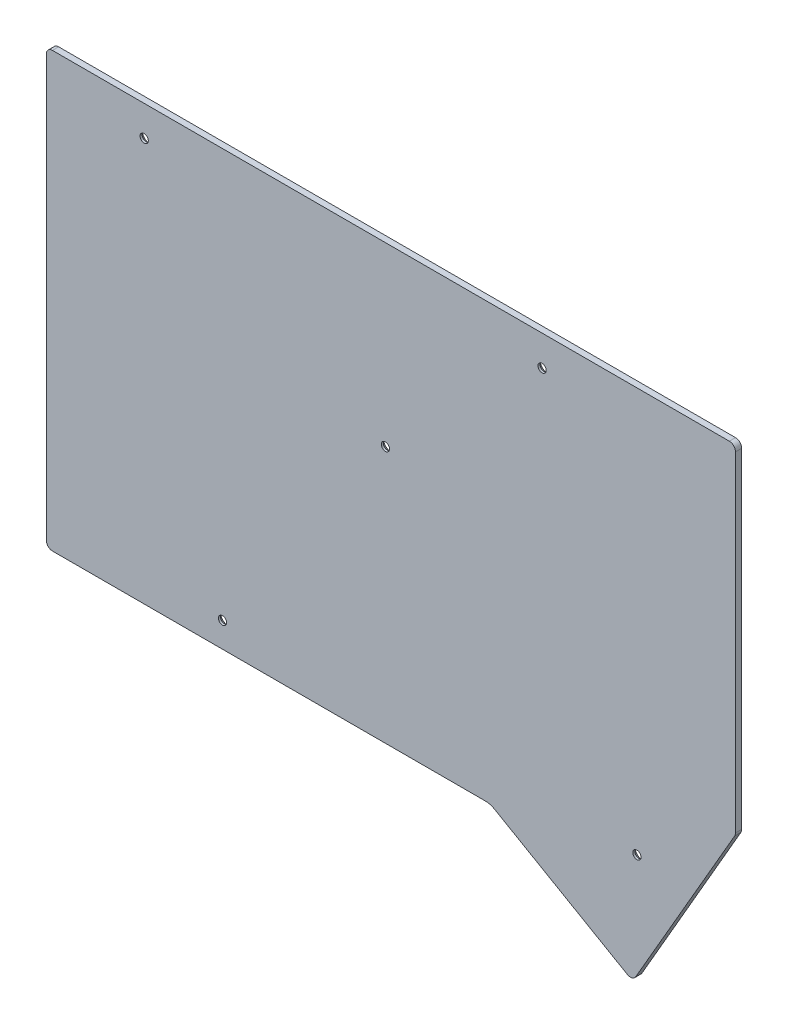
ISO-10303-21;
HEADER;
FILE_DESCRIPTION(('STEP AP214'),'2;1');
FILE_NAME('part.step','',(''),(''),'','','');
FILE_SCHEMA(('AUTOMOTIVE_DESIGN { 1 0 10303 214 1 1 1 1 }'));
ENDSEC;
DATA;
#1=APPLICATION_CONTEXT('core data for automotive mechanical design processes');
#2=APPLICATION_PROTOCOL_DEFINITION('international standard','automotive_design',2000,#1);
#3=PRODUCT_CONTEXT('',#1,'mechanical');
#4=PRODUCT('Part','Part','',(#3));
#5=PRODUCT_RELATED_PRODUCT_CATEGORY('part','',(#4));
#6=PRODUCT_DEFINITION_FORMATION('','',#4);
#7=PRODUCT_DEFINITION_CONTEXT('part definition',#1,'design');
#8=PRODUCT_DEFINITION('design','',#6,#7);
#9=PRODUCT_DEFINITION_SHAPE('','',#8);
#10=(LENGTH_UNIT() NAMED_UNIT(*) SI_UNIT(.MILLI.,.METRE.));
#11=(NAMED_UNIT(*) PLANE_ANGLE_UNIT() SI_UNIT($,.RADIAN.));
#12=(NAMED_UNIT(*) SI_UNIT($,.STERADIAN.) SOLID_ANGLE_UNIT());
#13=UNCERTAINTY_MEASURE_WITH_UNIT(LENGTH_MEASURE(1.E-05),#10,'distance_accuracy_value','');
#14=(GEOMETRIC_REPRESENTATION_CONTEXT(3) GLOBAL_UNCERTAINTY_ASSIGNED_CONTEXT((#13)) GLOBAL_UNIT_ASSIGNED_CONTEXT((#10,
#11,#12)) REPRESENTATION_CONTEXT('',''));
#15=CARTESIAN_POINT('',(0.,0.,0.));
#16=DIRECTION('',(0.,0.,1.));
#17=DIRECTION('',(1.,0.,0.));
#18=AXIS2_PLACEMENT_3D('',#15,#16,#17);
#19=CARTESIAN_POINT('',(20.7161288004973,150.424941971607,1.5));
#20=DIRECTION('',(0.,0.,1.));
#21=DIRECTION('',(1.,0.,0.));
#22=AXIS2_PLACEMENT_3D('',#19,#20,#21);
#23=PLANE('',#22);
#24=CARTESIAN_POINT('',(-102.196571110257,52.8250509716065,1.5));
#25=DIRECTION('',(0.,0.,1.));
#26=DIRECTION('',(1.,0.,0.));
#27=AXIS2_PLACEMENT_3D('',#24,#25,#26);
#28=CIRCLE('',#27,0.999999999999998);
#29=CARTESIAN_POINT('',(-101.196571110257,52.8250509716065,1.5));
#30=VERTEX_POINT('',#29);
#31=EDGE_CURVE('E336',#30,#30,#28,.T.);
#32=ORIENTED_EDGE('',*,*,#31,.F.);
#33=EDGE_LOOP('',(#32));
#34=FACE_BOUND('',#33,.T.);
#35=CARTESIAN_POINT('',(-121.196571210257,144.575050351607,1.5));
#36=DIRECTION('',(0.,0.,1.));
#37=DIRECTION('',(1.,0.,0.));
#38=AXIS2_PLACEMENT_3D('',#35,#36,#37);
#39=CIRCLE('',#38,0.999999999999998);
#40=CARTESIAN_POINT('',(-120.196571210257,144.575050351607,1.5));
#41=VERTEX_POINT('',#40);
#42=EDGE_CURVE('E335',#41,#41,#39,.T.);
#43=ORIENTED_EDGE('',*,*,#42,.F.);
#44=EDGE_LOOP('',(#43));
#45=FACE_BOUND('',#44,.T.);
#46=CARTESIAN_POINT('',(20.7161288004973,150.424941971607,1.5));
#47=DIRECTION('',(0.,0.,1.));
#48=DIRECTION('',(1.,0.,0.));
#49=AXIS2_PLACEMENT_3D('',#46,#47,#48);
#50=CIRCLE('',#49,1.5);
#51=CARTESIAN_POINT('',(22.2161288004973,150.424941971607,1.5));
#52=VERTEX_POINT('',#51);
#53=CARTESIAN_POINT('',(20.7161288004973,151.924941971607,1.5));
#54=VERTEX_POINT('',#53);
#55=EDGE_CURVE('E184',#52,#54,#50,.T.);
#56=ORIENTED_EDGE('',*,*,#55,.T.);
#57=DIRECTION('',(-1.,0.,0.));
#58=VECTOR('',#57,1.);
#59=CARTESIAN_POINT('',(20.7161288004973,151.924941971607,1.5));
#60=LINE('',#59,#58);
#61=CARTESIAN_POINT('',(-143.433871890257,151.924941971607,1.5));
#62=VERTEX_POINT('',#61);
#63=EDGE_CURVE('E112',#54,#62,#60,.T.);
#64=ORIENTED_EDGE('',*,*,#63,.T.);
#65=CARTESIAN_POINT('',(-143.433871890257,150.424941971607,1.5));
#66=DIRECTION('',(0.,0.,1.));
#67=DIRECTION('',(1.,0.,0.));
#68=AXIS2_PLACEMENT_3D('',#65,#66,#67);
#69=CIRCLE('',#68,1.5);
#70=CARTESIAN_POINT('',(-144.933871890257,150.424941971607,1.5));
#71=VERTEX_POINT('',#70);
#72=EDGE_CURVE('E349',#62,#71,#69,.T.);
#73=ORIENTED_EDGE('',*,*,#72,.T.);
#74=DIRECTION('',(0.,-1.,0.));
#75=VECTOR('',#74,1.);
#76=CARTESIAN_POINT('',(-144.933871890257,150.424941971607,1.5));
#77=LINE('',#76,#75);
#78=CARTESIAN_POINT('',(-144.933871890257,48.2618170516065,1.5));
#79=VERTEX_POINT('',#78);
#80=EDGE_CURVE('E351',#71,#79,#77,.T.);
#81=ORIENTED_EDGE('',*,*,#80,.T.);
#82=CARTESIAN_POINT('',(-143.433871890257,48.2618170516065,1.5));
#83=DIRECTION('',(0.,0.,1.));
#84=DIRECTION('',(1.,0.,0.));
#85=AXIS2_PLACEMENT_3D('',#82,#83,#84);
#86=CIRCLE('',#85,1.5);
#87=CARTESIAN_POINT('',(-143.433871890257,46.7618170516065,1.5));
#88=VERTEX_POINT('',#87);
#89=EDGE_CURVE('E353',#79,#88,#86,.T.);
#90=ORIENTED_EDGE('',*,*,#89,.T.);
#91=DIRECTION('',(1.,0.,0.));
#92=VECTOR('',#91,1.);
#93=CARTESIAN_POINT('',(-143.433871890257,46.7618170516065,1.5));
#94=LINE('',#93,#92);
#95=CARTESIAN_POINT('',(-38.493629317275,46.7618170516065,1.5));
#96=VERTEX_POINT('',#95);
#97=EDGE_CURVE('E355',#88,#96,#94,.T.);
#98=ORIENTED_EDGE('',*,*,#97,.T.);
#99=CARTESIAN_POINT('',(-38.493629317275,42.2618170516065,1.5));
#100=DIRECTION('',(0.,0.,-1.));
#101=DIRECTION('',(1.,0.,0.));
#102=AXIS2_PLACEMENT_3D('',#99,#100,#101);
#103=CIRCLE('',#102,4.5);
#104=CARTESIAN_POINT('',(-36.243629317275,46.1589313686365,1.5));
#105=VERTEX_POINT('',#104);
#106=EDGE_CURVE('E357',#96,#105,#103,.T.);
#107=ORIENTED_EDGE('',*,*,#106,.T.);
#108=DIRECTION('',(0.866025403784439,-0.5,0.));
#109=VECTOR('',#108,1.);
#110=CARTESIAN_POINT('',(-36.243629317275,46.1589313686365,1.5));
#111=LINE('',#110,#109);
#112=CARTESIAN_POINT('',(-4.01784738203959,27.5533674934822,1.5));
#113=VERTEX_POINT('',#112);
#114=EDGE_CURVE('E359',#105,#113,#111,.T.);
#115=ORIENTED_EDGE('',*,*,#114,.T.);
#116=CARTESIAN_POINT('',(-3.26784738203961,28.8524055991589,1.5));
#117=DIRECTION('',(0.,0.,1.));
#118=DIRECTION('',(1.,0.,0.));
#119=AXIS2_PLACEMENT_3D('',#116,#117,#118);
#120=CIRCLE('',#119,1.5);
#121=CARTESIAN_POINT('',(-1.96880929915792,28.1024055596768,1.5));
#122=VERTEX_POINT('',#121);
#123=EDGE_CURVE('E143',#113,#122,#120,.T.);
#124=ORIENTED_EDGE('',*,*,#123,.T.);
#125=DIRECTION('',(0.500000026321354,0.866025388587797,0.));
#126=VECTOR('',#125,1.);
#127=CARTESIAN_POINT('',(-1.96880929915792,28.1024055596768,1.5));
#128=LINE('',#127,#126);
#129=CARTESIAN_POINT('',(22.015166883379,69.6438679595458,1.5));
#130=VERTEX_POINT('',#129);
#131=EDGE_CURVE('E137',#122,#130,#128,.T.);
#132=ORIENTED_EDGE('',*,*,#131,.T.);
#133=CARTESIAN_POINT('',(20.7161288004973,70.3938679990278,1.5));
#134=DIRECTION('',(0.,0.,1.));
#135=DIRECTION('',(1.,0.,0.));
#136=AXIS2_PLACEMENT_3D('',#133,#134,#135);
#137=CIRCLE('',#136,1.50000000000001);
#138=CARTESIAN_POINT('',(22.2161288004973,70.3938679990278,1.5));
#139=VERTEX_POINT('',#138);
#140=EDGE_CURVE('E141',#130,#139,#137,.T.);
#141=ORIENTED_EDGE('',*,*,#140,.T.);
#142=DIRECTION('',(0.,1.,0.));
#143=VECTOR('',#142,1.);
#144=CARTESIAN_POINT('',(22.2161288004973,70.3938679990278,1.5));
#145=LINE('',#144,#143);
#146=EDGE_CURVE('E56',#139,#52,#145,.T.);
#147=ORIENTED_EDGE('',*,*,#146,.T.);
#148=EDGE_LOOP('',(#56,#64,#73,#81,#90,#98,#107,#115,#124,#132,#141,#147));
#149=FACE_BOUND('',#148,.T.);
#150=CARTESIAN_POINT('',(-24.6965711702571,144.575050351607,1.5));
#151=DIRECTION('',(0.,0.,1.));
#152=DIRECTION('',(1.,0.,0.));
#153=AXIS2_PLACEMENT_3D('',#150,#151,#152);
#154=CIRCLE('',#153,1.);
#155=CARTESIAN_POINT('',(-23.6965711702571,144.575050351607,1.5));
#156=VERTEX_POINT('',#155);
#157=EDGE_CURVE('E165',#156,#156,#154,.T.);
#158=ORIENTED_EDGE('',*,*,#157,.F.);
#159=EDGE_LOOP('',(#158));
#160=FACE_BOUND('',#159,.T.);
#161=CARTESIAN_POINT('',(-62.6965713702571,109.075050231607,1.5));
#162=DIRECTION('',(0.,0.,1.));
#163=DIRECTION('',(1.,0.,0.));
#164=AXIS2_PLACEMENT_3D('',#161,#162,#163);
#165=CIRCLE('',#164,0.999999999999998);
#166=CARTESIAN_POINT('',(-61.6965713702571,109.075050231607,1.5));
#167=VERTEX_POINT('',#166);
#168=EDGE_CURVE('E333',#167,#167,#165,.T.);
#169=ORIENTED_EDGE('',*,*,#168,.F.);
#170=EDGE_LOOP('',(#169));
#171=FACE_BOUND('',#170,.T.);
#172=CARTESIAN_POINT('',(-1.69657145025712,53.8250489716065,1.5));
#173=DIRECTION('',(0.,0.,1.));
#174=DIRECTION('',(1.,0.,0.));
#175=AXIS2_PLACEMENT_3D('',#172,#173,#174);
#176=CIRCLE('',#175,1.);
#177=CARTESIAN_POINT('',(-0.696571450257117,53.8250489716065,1.5));
#178=VERTEX_POINT('',#177);
#179=EDGE_CURVE('E341',#178,#178,#176,.T.);
#180=ORIENTED_EDGE('',*,*,#179,.F.);
#181=EDGE_LOOP('',(#180));
#182=FACE_BOUND('',#181,.T.);
#183=ADVANCED_FACE('F38',(#34,#45,#149,#160,#171,#182),#23,.T.);
#184=CARTESIAN_POINT('',(20.7161288004973,150.424941971607,0.));
#185=DIRECTION('',(0.,0.,1.));
#186=DIRECTION('',(1.,0.,0.));
#187=AXIS2_PLACEMENT_3D('',#184,#185,#186);
#188=PLANE('',#187);
#189=CARTESIAN_POINT('',(-24.6965711702571,144.575050351607,0.));
#190=DIRECTION('',(0.,0.,1.));
#191=DIRECTION('',(1.,0.,0.));
#192=AXIS2_PLACEMENT_3D('',#189,#190,#191);
#193=CIRCLE('',#192,1.99999999999997);
#194=CARTESIAN_POINT('',(-22.6965711702572,144.575050351607,0.));
#195=VERTEX_POINT('',#194);
#196=EDGE_CURVE('E223',#195,#195,#193,.T.);
#197=ORIENTED_EDGE('',*,*,#196,.T.);
#198=EDGE_LOOP('',(#197));
#199=FACE_BOUND('',#198,.T.);
#200=CARTESIAN_POINT('',(-121.196571210257,144.575050351607,0.));
#201=DIRECTION('',(0.,0.,1.));
#202=DIRECTION('',(1.,0.,0.));
#203=AXIS2_PLACEMENT_3D('',#200,#201,#202);
#204=CIRCLE('',#203,2.00000000000003);
#205=CARTESIAN_POINT('',(-119.196571210257,144.575050351607,0.));
#206=VERTEX_POINT('',#205);
#207=EDGE_CURVE('E220',#206,#206,#204,.T.);
#208=ORIENTED_EDGE('',*,*,#207,.T.);
#209=EDGE_LOOP('',(#208));
#210=FACE_BOUND('',#209,.T.);
#211=CARTESIAN_POINT('',(-62.6965713702571,109.075050231607,0.));
#212=DIRECTION('',(0.,0.,1.));
#213=DIRECTION('',(1.,0.,0.));
#214=AXIS2_PLACEMENT_3D('',#211,#212,#213);
#215=CIRCLE('',#214,2.00000000000003);
#216=CARTESIAN_POINT('',(-60.6965713702571,109.075050231607,0.));
#217=VERTEX_POINT('',#216);
#218=EDGE_CURVE('E217',#217,#217,#215,.T.);
#219=ORIENTED_EDGE('',*,*,#218,.T.);
#220=EDGE_LOOP('',(#219));
#221=FACE_BOUND('',#220,.T.);
#222=CARTESIAN_POINT('',(-1.69657145025712,53.8250489716065,0.));
#223=DIRECTION('',(0.,0.,1.));
#224=DIRECTION('',(1.,0.,0.));
#225=AXIS2_PLACEMENT_3D('',#222,#223,#224);
#226=CIRCLE('',#225,1.99999999999997);
#227=CARTESIAN_POINT('',(0.303428549742857,53.8250489716065,0.));
#228=VERTEX_POINT('',#227);
#229=EDGE_CURVE('E214',#228,#228,#226,.T.);
#230=ORIENTED_EDGE('',*,*,#229,.T.);
#231=EDGE_LOOP('',(#230));
#232=FACE_BOUND('',#231,.T.);
#233=CARTESIAN_POINT('',(-102.196571110257,52.8250509716065,0.));
#234=DIRECTION('',(0.,0.,1.));
#235=DIRECTION('',(1.,0.,0.));
#236=AXIS2_PLACEMENT_3D('',#233,#234,#235);
#237=CIRCLE('',#236,2.00000000000003);
#238=CARTESIAN_POINT('',(-100.196571110257,52.8250509716065,0.));
#239=VERTEX_POINT('',#238);
#240=EDGE_CURVE('E211',#239,#239,#237,.T.);
#241=ORIENTED_EDGE('',*,*,#240,.T.);
#242=EDGE_LOOP('',(#241));
#243=FACE_BOUND('',#242,.T.);
#244=CARTESIAN_POINT('',(20.7161288004973,150.424941971607,0.));
#245=DIRECTION('',(0.,0.,1.));
#246=DIRECTION('',(1.,0.,0.));
#247=AXIS2_PLACEMENT_3D('',#244,#245,#246);
#248=CIRCLE('',#247,1.5);
#249=CARTESIAN_POINT('',(22.2161288004973,150.424941971607,0.));
#250=VERTEX_POINT('',#249);
#251=CARTESIAN_POINT('',(20.7161288004973,151.924941971607,0.));
#252=VERTEX_POINT('',#251);
#253=EDGE_CURVE('E161',#250,#252,#248,.T.);
#254=ORIENTED_EDGE('',*,*,#253,.F.);
#255=DIRECTION('',(0.,1.,0.));
#256=VECTOR('',#255,1.);
#257=CARTESIAN_POINT('',(22.2161288004973,70.3938679990278,0.));
#258=LINE('',#257,#256);
#259=CARTESIAN_POINT('',(22.2161288004973,70.3938679990278,0.));
#260=VERTEX_POINT('',#259);
#261=EDGE_CURVE('E103',#260,#250,#258,.T.);
#262=ORIENTED_EDGE('',*,*,#261,.F.);
#263=CARTESIAN_POINT('',(20.7161288004973,70.3938679990278,0.));
#264=DIRECTION('',(0.,0.,1.));
#265=DIRECTION('',(1.,0.,0.));
#266=AXIS2_PLACEMENT_3D('',#263,#264,#265);
#267=CIRCLE('',#266,1.50000000000001);
#268=CARTESIAN_POINT('',(22.015166883379,69.6438679595458,0.));
#269=VERTEX_POINT('',#268);
#270=EDGE_CURVE('E97',#269,#260,#267,.T.);
#271=ORIENTED_EDGE('',*,*,#270,.F.);
#272=DIRECTION('',(0.500000026321354,0.866025388587797,0.));
#273=VECTOR('',#272,1.);
#274=CARTESIAN_POINT('',(-1.96880929915792,28.1024055596768,0.));
#275=LINE('',#274,#273);
#276=CARTESIAN_POINT('',(-1.96880929915792,28.1024055596768,0.));
#277=VERTEX_POINT('',#276);
#278=EDGE_CURVE('E151',#277,#269,#275,.T.);
#279=ORIENTED_EDGE('',*,*,#278,.F.);
#280=CARTESIAN_POINT('',(-3.26784738203961,28.8524055991589,0.));
#281=DIRECTION('',(0.,0.,1.));
#282=DIRECTION('',(1.,0.,0.));
#283=AXIS2_PLACEMENT_3D('',#280,#281,#282);
#284=CIRCLE('',#283,1.5);
#285=CARTESIAN_POINT('',(-4.01784738203959,27.5533674934822,0.));
#286=VERTEX_POINT('',#285);
#287=EDGE_CURVE('E179',#286,#277,#284,.T.);
#288=ORIENTED_EDGE('',*,*,#287,.F.);
#289=DIRECTION('',(0.866025403784439,-0.5,0.));
#290=VECTOR('',#289,1.);
#291=CARTESIAN_POINT('',(-36.243629317275,46.1589313686365,0.));
#292=LINE('',#291,#290);
#293=CARTESIAN_POINT('',(-36.243629317275,46.1589313686365,0.));
#294=VERTEX_POINT('',#293);
#295=EDGE_CURVE('E177',#294,#286,#292,.T.);
#296=ORIENTED_EDGE('',*,*,#295,.F.);
#297=CARTESIAN_POINT('',(-38.493629317275,42.2618170516065,0.));
#298=DIRECTION('',(0.,0.,-1.));
#299=DIRECTION('',(1.,0.,0.));
#300=AXIS2_PLACEMENT_3D('',#297,#298,#299);
#301=CIRCLE('',#300,4.5);
#302=CARTESIAN_POINT('',(-38.493629317275,46.7618170516065,0.));
#303=VERTEX_POINT('',#302);
#304=EDGE_CURVE('E175',#303,#294,#301,.T.);
#305=ORIENTED_EDGE('',*,*,#304,.F.);
#306=DIRECTION('',(1.,0.,0.));
#307=VECTOR('',#306,1.);
#308=CARTESIAN_POINT('',(-143.433871890257,46.7618170516065,0.));
#309=LINE('',#308,#307);
#310=CARTESIAN_POINT('',(-143.433871890257,46.7618170516065,0.));
#311=VERTEX_POINT('',#310);
#312=EDGE_CURVE('E173',#311,#303,#309,.T.);
#313=ORIENTED_EDGE('',*,*,#312,.F.);
#314=CARTESIAN_POINT('',(-143.433871890257,48.2618170516065,0.));
#315=DIRECTION('',(0.,0.,1.));
#316=DIRECTION('',(1.,0.,0.));
#317=AXIS2_PLACEMENT_3D('',#314,#315,#316);
#318=CIRCLE('',#317,1.5);
#319=CARTESIAN_POINT('',(-144.933871890257,48.2618170516065,0.));
#320=VERTEX_POINT('',#319);
#321=EDGE_CURVE('E171',#320,#311,#318,.T.);
#322=ORIENTED_EDGE('',*,*,#321,.F.);
#323=DIRECTION('',(0.,-1.,0.));
#324=VECTOR('',#323,1.);
#325=CARTESIAN_POINT('',(-144.933871890257,150.424941971607,0.));
#326=LINE('',#325,#324);
#327=CARTESIAN_POINT('',(-144.933871890257,150.424941971607,0.));
#328=VERTEX_POINT('',#327);
#329=EDGE_CURVE('E169',#328,#320,#326,.T.);
#330=ORIENTED_EDGE('',*,*,#329,.F.);
#331=CARTESIAN_POINT('',(-143.433871890257,150.424941971607,0.));
#332=DIRECTION('',(0.,0.,1.));
#333=DIRECTION('',(1.,0.,0.));
#334=AXIS2_PLACEMENT_3D('',#331,#332,#333);
#335=CIRCLE('',#334,1.5);
#336=CARTESIAN_POINT('',(-143.433871890257,151.924941971607,0.));
#337=VERTEX_POINT('',#336);
#338=EDGE_CURVE('E167',#337,#328,#335,.T.);
#339=ORIENTED_EDGE('',*,*,#338,.F.);
#340=DIRECTION('',(-1.,0.,0.));
#341=VECTOR('',#340,1.);
#342=CARTESIAN_POINT('',(20.7161288004973,151.924941971607,0.));
#343=LINE('',#342,#341);
#344=EDGE_CURVE('E164',#252,#337,#343,.T.);
#345=ORIENTED_EDGE('',*,*,#344,.F.);
#346=EDGE_LOOP('',(#254,#262,#271,#279,#288,#296,#305,#313,#322,#330,#339,#345));
#347=FACE_BOUND('',#346,.T.);
#348=ADVANCED_FACE('F246',(#199,#210,#221,#232,#243,#347),#188,.F.);
#349=CARTESIAN_POINT('',(20.7161288004973,150.424941971607,1.5));
#350=DIRECTION('',(0.,0.,-1.));
#351=DIRECTION('',(-1.,0.,0.));
#352=AXIS2_PLACEMENT_3D('',#349,#350,#351);
#353=CYLINDRICAL_SURFACE('',#352,1.5);
#354=ORIENTED_EDGE('',*,*,#253,.T.);
#355=DIRECTION('',(0.,0.,-1.));
#356=VECTOR('',#355,1.);
#357=CARTESIAN_POINT('',(20.7161288004973,151.924941971607,1.5));
#358=LINE('',#357,#356);
#359=EDGE_CURVE('E209',#54,#252,#358,.T.);
#360=ORIENTED_EDGE('',*,*,#359,.F.);
#361=ORIENTED_EDGE('',*,*,#55,.F.);
#362=DIRECTION('',(0.,0.,-1.));
#363=VECTOR('',#362,1.);
#364=CARTESIAN_POINT('',(22.2161288004973,150.424941971607,1.5));
#365=LINE('',#364,#363);
#366=EDGE_CURVE('E157',#52,#250,#365,.T.);
#367=ORIENTED_EDGE('',*,*,#366,.T.);
#368=EDGE_LOOP('',(#354,#360,#361,#367));
#369=FACE_BOUND('',#368,.T.);
#370=ADVANCED_FACE('F249',(#369),#353,.T.);
#371=CARTESIAN_POINT('',(20.7161288004973,151.924941971607,1.5));
#372=DIRECTION('',(0.,-1.,0.));
#373=DIRECTION('',(1.,0.,0.));
#374=AXIS2_PLACEMENT_3D('',#371,#372,#373);
#375=PLANE('',#374);
#376=ORIENTED_EDGE('',*,*,#344,.T.);
#377=DIRECTION('',(0.,0.,-1.));
#378=VECTOR('',#377,1.);
#379=CARTESIAN_POINT('',(-143.433871890257,151.924941971607,1.5));
#380=LINE('',#379,#378);
#381=EDGE_CURVE('E206',#62,#337,#380,.T.);
#382=ORIENTED_EDGE('',*,*,#381,.F.);
#383=ORIENTED_EDGE('',*,*,#63,.F.);
#384=ORIENTED_EDGE('',*,*,#359,.T.);
#385=EDGE_LOOP('',(#376,#382,#383,#384));
#386=FACE_BOUND('',#385,.T.);
#387=ADVANCED_FACE('F392',(#386),#375,.F.);
#388=CARTESIAN_POINT('',(-143.433871890257,150.424941971607,1.5));
#389=DIRECTION('',(0.,0.,-1.));
#390=DIRECTION('',(-1.,0.,0.));
#391=AXIS2_PLACEMENT_3D('',#388,#389,#390);
#392=CYLINDRICAL_SURFACE('',#391,1.5);
#393=ORIENTED_EDGE('',*,*,#338,.T.);
#394=DIRECTION('',(0.,0.,-1.));
#395=VECTOR('',#394,1.);
#396=CARTESIAN_POINT('',(-144.933871890257,150.424941971607,1.5));
#397=LINE('',#396,#395);
#398=EDGE_CURVE('E203',#71,#328,#397,.T.);
#399=ORIENTED_EDGE('',*,*,#398,.F.);
#400=ORIENTED_EDGE('',*,*,#72,.F.);
#401=ORIENTED_EDGE('',*,*,#381,.T.);
#402=EDGE_LOOP('',(#393,#399,#400,#401));
#403=FACE_BOUND('',#402,.T.);
#404=ADVANCED_FACE('F391',(#403),#392,.T.);
#405=CARTESIAN_POINT('',(-144.933871890257,150.424941971607,1.5));
#406=DIRECTION('',(1.,0.,0.));
#407=DIRECTION('',(0.,0.,-1.));
#408=AXIS2_PLACEMENT_3D('',#405,#406,#407);
#409=PLANE('',#408);
#410=ORIENTED_EDGE('',*,*,#329,.T.);
#411=DIRECTION('',(0.,0.,-1.));
#412=VECTOR('',#411,1.);
#413=CARTESIAN_POINT('',(-144.933871890257,48.2618170516065,1.5));
#414=LINE('',#413,#412);
#415=EDGE_CURVE('E200',#79,#320,#414,.T.);
#416=ORIENTED_EDGE('',*,*,#415,.F.);
#417=ORIENTED_EDGE('',*,*,#80,.F.);
#418=ORIENTED_EDGE('',*,*,#398,.T.);
#419=EDGE_LOOP('',(#410,#416,#417,#418));
#420=FACE_BOUND('',#419,.T.);
#421=ADVANCED_FACE('F386',(#420),#409,.F.);
#422=CARTESIAN_POINT('',(-143.433871890257,48.2618170516065,1.5));
#423=DIRECTION('',(0.,0.,-1.));
#424=DIRECTION('',(-1.,0.,0.));
#425=AXIS2_PLACEMENT_3D('',#422,#423,#424);
#426=CYLINDRICAL_SURFACE('',#425,1.5);
#427=ORIENTED_EDGE('',*,*,#321,.T.);
#428=DIRECTION('',(0.,0.,-1.));
#429=VECTOR('',#428,1.);
#430=CARTESIAN_POINT('',(-143.433871890257,46.7618170516065,1.5));
#431=LINE('',#430,#429);
#432=EDGE_CURVE('E197',#88,#311,#431,.T.);
#433=ORIENTED_EDGE('',*,*,#432,.F.);
#434=ORIENTED_EDGE('',*,*,#89,.F.);
#435=ORIENTED_EDGE('',*,*,#415,.T.);
#436=EDGE_LOOP('',(#427,#433,#434,#435));
#437=FACE_BOUND('',#436,.T.);
#438=ADVANCED_FACE('F382',(#437),#426,.T.);
#439=CARTESIAN_POINT('',(-143.433871890257,46.7618170516065,1.5));
#440=DIRECTION('',(0.,1.,0.));
#441=DIRECTION('',(0.,0.,1.));
#442=AXIS2_PLACEMENT_3D('',#439,#440,#441);
#443=PLANE('',#442);
#444=ORIENTED_EDGE('',*,*,#312,.T.);
#445=DIRECTION('',(0.,0.,-1.));
#446=VECTOR('',#445,1.);
#447=CARTESIAN_POINT('',(-38.493629317275,46.7618170516065,1.5));
#448=LINE('',#447,#446);
#449=EDGE_CURVE('E194',#96,#303,#448,.T.);
#450=ORIENTED_EDGE('',*,*,#449,.F.);
#451=ORIENTED_EDGE('',*,*,#97,.F.);
#452=ORIENTED_EDGE('',*,*,#432,.T.);
#453=EDGE_LOOP('',(#444,#450,#451,#452));
#454=FACE_BOUND('',#453,.T.);
#455=ADVANCED_FACE('F378',(#454),#443,.F.);
#456=CARTESIAN_POINT('',(-38.493629317275,42.2618170516065,1.5));
#457=DIRECTION('',(0.,0.,-1.));
#458=DIRECTION('',(-1.,0.,0.));
#459=AXIS2_PLACEMENT_3D('',#456,#457,#458);
#460=CYLINDRICAL_SURFACE('',#459,4.5);
#461=ORIENTED_EDGE('',*,*,#304,.T.);
#462=DIRECTION('',(0.,0.,-1.));
#463=VECTOR('',#462,1.);
#464=CARTESIAN_POINT('',(-36.243629317275,46.1589313686365,1.5));
#465=LINE('',#464,#463);
#466=EDGE_CURVE('E191',#105,#294,#465,.T.);
#467=ORIENTED_EDGE('',*,*,#466,.F.);
#468=ORIENTED_EDGE('',*,*,#106,.F.);
#469=ORIENTED_EDGE('',*,*,#449,.T.);
#470=EDGE_LOOP('',(#461,#467,#468,#469));
#471=FACE_BOUND('',#470,.T.);
#472=ADVANCED_FACE('F374',(#471),#460,.F.);
#473=CARTESIAN_POINT('',(-36.243629317275,46.1589313686365,1.5));
#474=DIRECTION('',(0.5,0.866025403784438,0.));
#475=DIRECTION('',(-0.866025403784439,0.5,0.));
#476=AXIS2_PLACEMENT_3D('',#473,#474,#475);
#477=PLANE('',#476);
#478=ORIENTED_EDGE('',*,*,#295,.T.);
#479=DIRECTION('',(0.,0.,-1.));
#480=VECTOR('',#479,1.);
#481=CARTESIAN_POINT('',(-4.01784738203959,27.5533674934822,1.5));
#482=LINE('',#481,#480);
#483=EDGE_CURVE('E188',#113,#286,#482,.T.);
#484=ORIENTED_EDGE('',*,*,#483,.F.);
#485=ORIENTED_EDGE('',*,*,#114,.F.);
#486=ORIENTED_EDGE('',*,*,#466,.T.);
#487=EDGE_LOOP('',(#478,#484,#485,#486));
#488=FACE_BOUND('',#487,.T.);
#489=ADVANCED_FACE('F365',(#488),#477,.F.);
#490=CARTESIAN_POINT('',(-3.26784738203961,28.8524055991589,1.5));
#491=DIRECTION('',(0.,0.,-1.));
#492=DIRECTION('',(-1.,0.,0.));
#493=AXIS2_PLACEMENT_3D('',#490,#491,#492);
#494=CYLINDRICAL_SURFACE('',#493,1.5);
#495=ORIENTED_EDGE('',*,*,#287,.T.);
#496=DIRECTION('',(0.,0.,-1.));
#497=VECTOR('',#496,1.);
#498=CARTESIAN_POINT('',(-1.96880929915792,28.1024055596768,1.5));
#499=LINE('',#498,#497);
#500=EDGE_CURVE('E152',#122,#277,#499,.T.);
#501=ORIENTED_EDGE('',*,*,#500,.F.);
#502=ORIENTED_EDGE('',*,*,#123,.F.);
#503=ORIENTED_EDGE('',*,*,#483,.T.);
#504=EDGE_LOOP('',(#495,#501,#502,#503));
#505=FACE_BOUND('',#504,.T.);
#506=ADVANCED_FACE('F369',(#505),#494,.T.);
#507=CARTESIAN_POINT('',(-1.96880929915792,28.1024055596768,1.5));
#508=DIRECTION('',(-0.866025388587797,0.500000026321354,0.));
#509=DIRECTION('',(-0.500000026321354,-0.866025388587797,0.));
#510=AXIS2_PLACEMENT_3D('',#507,#508,#509);
#511=PLANE('',#510);
#512=ORIENTED_EDGE('',*,*,#278,.T.);
#513=DIRECTION('',(0.,0.,-1.));
#514=VECTOR('',#513,1.);
#515=CARTESIAN_POINT('',(22.015166883379,69.6438679595458,1.5));
#516=LINE('',#515,#514);
#517=EDGE_CURVE('E148',#130,#269,#516,.T.);
#518=ORIENTED_EDGE('',*,*,#517,.F.);
#519=ORIENTED_EDGE('',*,*,#131,.F.);
#520=ORIENTED_EDGE('',*,*,#500,.T.);
#521=EDGE_LOOP('',(#512,#518,#519,#520));
#522=FACE_BOUND('',#521,.T.);
#523=ADVANCED_FACE('F149',(#522),#511,.F.);
#524=CARTESIAN_POINT('',(20.7161288004973,70.3938679990278,1.5));
#525=DIRECTION('',(0.,0.,-1.));
#526=DIRECTION('',(-1.,0.,0.));
#527=AXIS2_PLACEMENT_3D('',#524,#525,#526);
#528=CYLINDRICAL_SURFACE('',#527,1.50000000000001);
#529=ORIENTED_EDGE('',*,*,#270,.T.);
#530=DIRECTION('',(0.,0.,-1.));
#531=VECTOR('',#530,1.);
#532=CARTESIAN_POINT('',(22.2161288004973,70.3938679990278,1.5));
#533=LINE('',#532,#531);
#534=EDGE_CURVE('E153',#139,#260,#533,.T.);
#535=ORIENTED_EDGE('',*,*,#534,.F.);
#536=ORIENTED_EDGE('',*,*,#140,.F.);
#537=ORIENTED_EDGE('',*,*,#517,.T.);
#538=EDGE_LOOP('',(#529,#535,#536,#537));
#539=FACE_BOUND('',#538,.T.);
#540=ADVANCED_FACE('F155',(#539),#528,.T.);
#541=CARTESIAN_POINT('',(22.2161288004973,70.3938679990278,1.5));
#542=DIRECTION('',(-1.,0.,0.));
#543=DIRECTION('',(0.,-1.,0.));
#544=AXIS2_PLACEMENT_3D('',#541,#542,#543);
#545=PLANE('',#544);
#546=ORIENTED_EDGE('',*,*,#261,.T.);
#547=ORIENTED_EDGE('',*,*,#366,.F.);
#548=ORIENTED_EDGE('',*,*,#146,.F.);
#549=ORIENTED_EDGE('',*,*,#534,.T.);
#550=EDGE_LOOP('',(#546,#547,#548,#549));
#551=FACE_BOUND('',#550,.T.);
#552=ADVANCED_FACE('F259',(#551),#545,.F.);
#553=CARTESIAN_POINT('',(-24.6965711702571,144.575050351607,1.5));
#554=DIRECTION('',(0.,0.,-1.));
#555=DIRECTION('',(-1.,0.,0.));
#556=AXIS2_PLACEMENT_3D('',#553,#554,#555);
#557=CYLINDRICAL_SURFACE('',#556,1.);
#558=CARTESIAN_POINT('',(-24.6965711702571,144.575050351607,0.999999999999969));
#559=DIRECTION('',(0.,0.,1.));
#560=DIRECTION('',(1.,0.,0.));
#561=AXIS2_PLACEMENT_3D('',#558,#559,#560);
#562=CIRCLE('',#561,1.);
#563=CARTESIAN_POINT('',(-23.6965711702571,144.575050351607,0.999999999999969));
#564=VERTEX_POINT('',#563);
#565=EDGE_CURVE('E226',#564,#564,#562,.F.);
#566=ORIENTED_EDGE('',*,*,#565,.T.);
#567=EDGE_LOOP('',(#566));
#568=FACE_BOUND('',#567,.T.);
#569=ORIENTED_EDGE('',*,*,#157,.T.);
#570=EDGE_LOOP('',(#569));
#571=FACE_BOUND('',#570,.T.);
#572=ADVANCED_FACE('F261',(#568,#571),#557,.F.);
#573=CARTESIAN_POINT('',(-121.196571210257,144.575050351607,1.5));
#574=DIRECTION('',(0.,0.,-1.));
#575=DIRECTION('',(-1.,0.,0.));
#576=AXIS2_PLACEMENT_3D('',#573,#574,#575);
#577=CYLINDRICAL_SURFACE('',#576,0.999999999999998);
#578=CARTESIAN_POINT('',(-121.196571210257,144.575050351607,1.00000000000001));
#579=DIRECTION('',(0.,0.,1.));
#580=DIRECTION('',(1.,0.,0.));
#581=AXIS2_PLACEMENT_3D('',#578,#579,#580);
#582=CIRCLE('',#581,0.999999999999998);
#583=CARTESIAN_POINT('',(-120.196571210257,144.575050351607,1.00000000000001));
#584=VERTEX_POINT('',#583);
#585=EDGE_CURVE('E229',#584,#584,#582,.F.);
#586=ORIENTED_EDGE('',*,*,#585,.T.);
#587=EDGE_LOOP('',(#586));
#588=FACE_BOUND('',#587,.T.);
#589=ORIENTED_EDGE('',*,*,#42,.T.);
#590=EDGE_LOOP('',(#589));
#591=FACE_BOUND('',#590,.T.);
#592=ADVANCED_FACE('F267',(#588,#591),#577,.F.);
#593=CARTESIAN_POINT('',(-62.6965713702571,109.075050231607,1.5));
#594=DIRECTION('',(0.,0.,-1.));
#595=DIRECTION('',(-1.,0.,0.));
#596=AXIS2_PLACEMENT_3D('',#593,#594,#595);
#597=CYLINDRICAL_SURFACE('',#596,0.999999999999998);
#598=CARTESIAN_POINT('',(-62.6965713702571,109.075050231607,1.00000000000001));
#599=DIRECTION('',(0.,0.,1.));
#600=DIRECTION('',(1.,0.,0.));
#601=AXIS2_PLACEMENT_3D('',#598,#599,#600);
#602=CIRCLE('',#601,0.999999999999998);
#603=CARTESIAN_POINT('',(-61.6965713702571,109.075050231607,1.00000000000001));
#604=VERTEX_POINT('',#603);
#605=EDGE_CURVE('E232',#604,#604,#602,.F.);
#606=ORIENTED_EDGE('',*,*,#605,.T.);
#607=EDGE_LOOP('',(#606));
#608=FACE_BOUND('',#607,.T.);
#609=ORIENTED_EDGE('',*,*,#168,.T.);
#610=EDGE_LOOP('',(#609));
#611=FACE_BOUND('',#610,.T.);
#612=ADVANCED_FACE('F281',(#608,#611),#597,.F.);
#613=CARTESIAN_POINT('',(-102.196571110257,52.8250509716065,1.5));
#614=DIRECTION('',(0.,0.,-1.));
#615=DIRECTION('',(-1.,0.,0.));
#616=AXIS2_PLACEMENT_3D('',#613,#614,#615);
#617=CYLINDRICAL_SURFACE('',#616,0.999999999999998);
#618=CARTESIAN_POINT('',(-102.196571110257,52.8250509716065,1.00000000000001));
#619=DIRECTION('',(0.,0.,1.));
#620=DIRECTION('',(1.,0.,0.));
#621=AXIS2_PLACEMENT_3D('',#618,#619,#620);
#622=CIRCLE('',#621,0.999999999999998);
#623=CARTESIAN_POINT('',(-101.196571110257,52.8250509716065,1.00000000000001));
#624=VERTEX_POINT('',#623);
#625=EDGE_CURVE('E11',#624,#624,#622,.F.);
#626=ORIENTED_EDGE('',*,*,#625,.T.);
#627=EDGE_LOOP('',(#626));
#628=FACE_BOUND('',#627,.T.);
#629=ORIENTED_EDGE('',*,*,#31,.T.);
#630=EDGE_LOOP('',(#629));
#631=FACE_BOUND('',#630,.T.);
#632=ADVANCED_FACE('F285',(#628,#631),#617,.F.);
#633=CARTESIAN_POINT('',(-1.69657145025712,53.8250489716065,1.5));
#634=DIRECTION('',(0.,0.,-1.));
#635=DIRECTION('',(-1.,0.,0.));
#636=AXIS2_PLACEMENT_3D('',#633,#634,#635);
#637=CYLINDRICAL_SURFACE('',#636,1.);
#638=CARTESIAN_POINT('',(-1.69657145025712,53.8250489716065,0.99999999999997));
#639=DIRECTION('',(0.,0.,1.));
#640=DIRECTION('',(1.,0.,0.));
#641=AXIS2_PLACEMENT_3D('',#638,#639,#640);
#642=CIRCLE('',#641,1.);
#643=CARTESIAN_POINT('',(-0.696571450257117,53.8250489716065,0.99999999999997));
#644=VERTEX_POINT('',#643);
#645=EDGE_CURVE('E48',#644,#644,#642,.F.);
#646=ORIENTED_EDGE('',*,*,#645,.T.);
#647=EDGE_LOOP('',(#646));
#648=FACE_BOUND('',#647,.T.);
#649=ORIENTED_EDGE('',*,*,#179,.T.);
#650=EDGE_LOOP('',(#649));
#651=FACE_BOUND('',#650,.T.);
#652=ADVANCED_FACE('F237',(#648,#651),#637,.F.);
#653=CARTESIAN_POINT('',(-24.6965711702571,144.575050351607,0.));
#654=DIRECTION('',(0.,0.,-1.));
#655=DIRECTION('',(-1.,0.,0.));
#656=AXIS2_PLACEMENT_3D('',#653,#654,#655);
#657=CONICAL_SURFACE('',#656,1.99999999999997,0.78539816339745);
#658=ORIENTED_EDGE('',*,*,#565,.F.);
#659=EDGE_LOOP('',(#658));
#660=FACE_BOUND('',#659,.T.);
#661=ORIENTED_EDGE('',*,*,#196,.F.);
#662=EDGE_LOOP('',(#661));
#663=FACE_BOUND('',#662,.T.);
#664=ADVANCED_FACE('F291',(#660,#663),#657,.F.);
#665=CARTESIAN_POINT('',(-121.196571210257,144.575050351607,0.));
#666=DIRECTION('',(0.,0.,-1.));
#667=DIRECTION('',(-1.,0.,0.));
#668=AXIS2_PLACEMENT_3D('',#665,#666,#667);
#669=CONICAL_SURFACE('',#668,2.00000000000003,0.78539816339746);
#670=ORIENTED_EDGE('',*,*,#585,.F.);
#671=EDGE_LOOP('',(#670));
#672=FACE_BOUND('',#671,.T.);
#673=ORIENTED_EDGE('',*,*,#207,.F.);
#674=EDGE_LOOP('',(#673));
#675=FACE_BOUND('',#674,.T.);
#676=ADVANCED_FACE('F295',(#672,#675),#669,.F.);
#677=CARTESIAN_POINT('',(-62.6965713702571,109.075050231607,0.));
#678=DIRECTION('',(0.,0.,-1.));
#679=DIRECTION('',(-1.,0.,0.));
#680=AXIS2_PLACEMENT_3D('',#677,#678,#679);
#681=CONICAL_SURFACE('',#680,2.00000000000003,0.78539816339746);
#682=ORIENTED_EDGE('',*,*,#605,.F.);
#683=EDGE_LOOP('',(#682));
#684=FACE_BOUND('',#683,.T.);
#685=ORIENTED_EDGE('',*,*,#218,.F.);
#686=EDGE_LOOP('',(#685));
#687=FACE_BOUND('',#686,.T.);
#688=ADVANCED_FACE('F243',(#684,#687),#681,.F.);
#689=CARTESIAN_POINT('',(-1.69657145025712,53.8250489716065,0.));
#690=DIRECTION('',(0.,0.,-1.));
#691=DIRECTION('',(-1.,0.,0.));
#692=AXIS2_PLACEMENT_3D('',#689,#690,#691);
#693=CONICAL_SURFACE('',#692,1.99999999999997,0.78539816339745);
#694=ORIENTED_EDGE('',*,*,#645,.F.);
#695=EDGE_LOOP('',(#694));
#696=FACE_BOUND('',#695,.T.);
#697=ORIENTED_EDGE('',*,*,#229,.F.);
#698=EDGE_LOOP('',(#697));
#699=FACE_BOUND('',#698,.T.);
#700=ADVANCED_FACE('F240',(#696,#699),#693,.F.);
#701=CARTESIAN_POINT('',(-102.196571110257,52.8250509716065,0.));
#702=DIRECTION('',(0.,0.,-1.));
#703=DIRECTION('',(-1.,0.,0.));
#704=AXIS2_PLACEMENT_3D('',#701,#702,#703);
#705=CONICAL_SURFACE('',#704,2.00000000000003,0.78539816339746);
#706=ORIENTED_EDGE('',*,*,#625,.F.);
#707=EDGE_LOOP('',(#706));
#708=FACE_BOUND('',#707,.T.);
#709=ORIENTED_EDGE('',*,*,#240,.F.);
#710=EDGE_LOOP('',(#709));
#711=FACE_BOUND('',#710,.T.);
#712=ADVANCED_FACE('F41',(#708,#711),#705,.F.);
#713=CLOSED_SHELL('',(#183,#348,#370,#387,#404,#421,#438,#455,#472,#489,#506,#523,#540,#552,
#572,#592,#612,#632,#652,#664,#676,#688,#700,#712));
#714=MANIFOLD_SOLID_BREP('B2',#713);
#715=ADVANCED_BREP_SHAPE_REPRESENTATION('',(#18,#714),#14);
#716=SHAPE_DEFINITION_REPRESENTATION(#9,#715);
ENDSEC;
END-ISO-10303-21;
